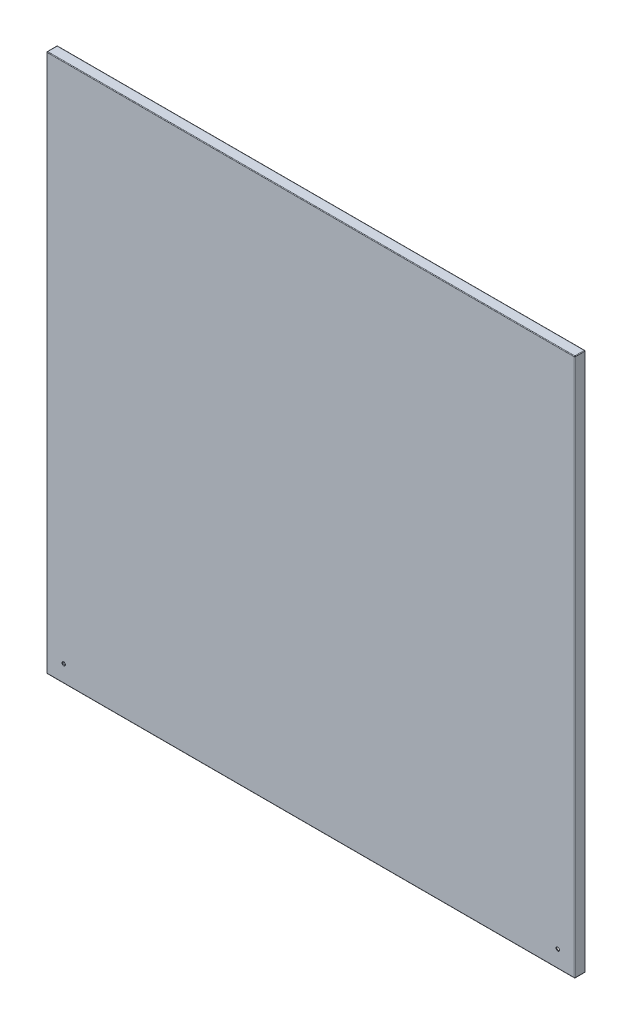
ISO-10303-21;
HEADER;
FILE_DESCRIPTION(('STEP AP214'),'2;1');
FILE_NAME('part.step','',(''),(''),'','','');
FILE_SCHEMA(('AUTOMOTIVE_DESIGN { 1 0 10303 214 1 1 1 1 }'));
ENDSEC;
DATA;
#1=APPLICATION_CONTEXT('core data for automotive mechanical design processes');
#2=APPLICATION_PROTOCOL_DEFINITION('international standard','automotive_design',2000,#1);
#3=PRODUCT_CONTEXT('',#1,'mechanical');
#4=PRODUCT('Part','Part','',(#3));
#5=PRODUCT_RELATED_PRODUCT_CATEGORY('part','',(#4));
#6=PRODUCT_DEFINITION_FORMATION('','',#4);
#7=PRODUCT_DEFINITION_CONTEXT('part definition',#1,'design');
#8=PRODUCT_DEFINITION('design','',#6,#7);
#9=PRODUCT_DEFINITION_SHAPE('','',#8);
#10=(LENGTH_UNIT() NAMED_UNIT(*) SI_UNIT(.MILLI.,.METRE.));
#11=(NAMED_UNIT(*) PLANE_ANGLE_UNIT() SI_UNIT($,.RADIAN.));
#12=(NAMED_UNIT(*) SI_UNIT($,.STERADIAN.) SOLID_ANGLE_UNIT());
#13=UNCERTAINTY_MEASURE_WITH_UNIT(LENGTH_MEASURE(1.E-05),#10,'distance_accuracy_value','');
#14=(GEOMETRIC_REPRESENTATION_CONTEXT(3) GLOBAL_UNCERTAINTY_ASSIGNED_CONTEXT((#13)) GLOBAL_UNIT_ASSIGNED_CONTEXT((#10,
#11,#12)) REPRESENTATION_CONTEXT('',''));
#15=CARTESIAN_POINT('',(0.,0.,0.));
#16=DIRECTION('',(0.,0.,1.));
#17=DIRECTION('',(1.,0.,0.));
#18=AXIS2_PLACEMENT_3D('',#15,#16,#17);
#19=CARTESIAN_POINT('',(-450.,-459.,1.5));
#20=DIRECTION('',(1.,0.,0.));
#21=DIRECTION('',(0.,0.,-1.));
#22=AXIS2_PLACEMENT_3D('',#19,#20,#21);
#23=PLANE('',#22);
#24=DIRECTION('',(0.,-1.,0.));
#25=VECTOR('',#24,1.);
#26=CARTESIAN_POINT('',(-450.,459.,0.5));
#27=LINE('',#26,#25);
#28=CARTESIAN_POINT('',(-450.,-458.,0.5));
#29=VERTEX_POINT('',#28);
#30=CARTESIAN_POINT('',(-450.,458.,0.5));
#31=VERTEX_POINT('',#30);
#32=EDGE_CURVE('E295',#29,#31,#27,.F.);
#33=ORIENTED_EDGE('',*,*,#32,.T.);
#34=DIRECTION('',(0.,0.,-1.));
#35=VECTOR('',#34,1.);
#36=CARTESIAN_POINT('',(-450.,458.,1.5));
#37=LINE('',#36,#35);
#38=CARTESIAN_POINT('',(-450.,458.,-15.5));
#39=VERTEX_POINT('',#38);
#40=EDGE_CURVE('E301',#31,#39,#37,.T.);
#41=ORIENTED_EDGE('',*,*,#40,.T.);
#42=DIRECTION('',(0.,1.,0.));
#43=VECTOR('',#42,1.);
#44=CARTESIAN_POINT('',(-450.,-459.,-15.5));
#45=LINE('',#44,#43);
#46=CARTESIAN_POINT('',(-450.,-458.,-15.5));
#47=VERTEX_POINT('',#46);
#48=EDGE_CURVE('E299',#39,#47,#45,.F.);
#49=ORIENTED_EDGE('',*,*,#48,.T.);
#50=DIRECTION('',(0.,0.,-1.));
#51=VECTOR('',#50,1.);
#52=CARTESIAN_POINT('',(-450.,-458.,1.5));
#53=LINE('',#52,#51);
#54=EDGE_CURVE('E297',#47,#29,#53,.F.);
#55=ORIENTED_EDGE('',*,*,#54,.T.);
#56=EDGE_LOOP('',(#33,#41,#49,#55));
#57=FACE_BOUND('',#56,.T.);
#58=ADVANCED_FACE('F34',(#57),#23,.F.);
#59=CARTESIAN_POINT('',(450.,-459.,1.5));
#60=DIRECTION('',(0.,1.,0.));
#61=DIRECTION('',(-1.,0.,0.));
#62=AXIS2_PLACEMENT_3D('',#59,#60,#61);
#63=PLANE('',#62);
#64=DIRECTION('',(0.,0.,-1.));
#65=VECTOR('',#64,1.);
#66=CARTESIAN_POINT('',(-449.,-459.,1.5));
#67=LINE('',#66,#65);
#68=CARTESIAN_POINT('',(-449.,-459.,0.5));
#69=VERTEX_POINT('',#68);
#70=CARTESIAN_POINT('',(-449.,-459.,-15.5));
#71=VERTEX_POINT('',#70);
#72=EDGE_CURVE('E270',#69,#71,#67,.T.);
#73=ORIENTED_EDGE('',*,*,#72,.T.);
#74=DIRECTION('',(-1.,0.,0.));
#75=VECTOR('',#74,1.);
#76=CARTESIAN_POINT('',(450.,-459.,-15.5));
#77=LINE('',#76,#75);
#78=CARTESIAN_POINT('',(449.,-459.,-15.5));
#79=VERTEX_POINT('',#78);
#80=EDGE_CURVE('E274',#71,#79,#77,.F.);
#81=ORIENTED_EDGE('',*,*,#80,.T.);
#82=DIRECTION('',(0.,0.,-1.));
#83=VECTOR('',#82,1.);
#84=CARTESIAN_POINT('',(449.,-459.,1.5));
#85=LINE('',#84,#83);
#86=CARTESIAN_POINT('',(449.,-459.,0.5));
#87=VERTEX_POINT('',#86);
#88=EDGE_CURVE('E272',#79,#87,#85,.F.);
#89=ORIENTED_EDGE('',*,*,#88,.T.);
#90=DIRECTION('',(1.,0.,0.));
#91=VECTOR('',#90,1.);
#92=CARTESIAN_POINT('',(-450.,-459.,0.5));
#93=LINE('',#92,#91);
#94=EDGE_CURVE('E268',#87,#69,#93,.F.);
#95=ORIENTED_EDGE('',*,*,#94,.T.);
#96=EDGE_LOOP('',(#73,#81,#89,#95));
#97=FACE_BOUND('',#96,.T.);
#98=ADVANCED_FACE('F404',(#97),#63,.F.);
#99=CARTESIAN_POINT('',(450.,-459.,1.5));
#100=DIRECTION('',(-1.,0.,0.));
#101=DIRECTION('',(0.,0.,1.));
#102=AXIS2_PLACEMENT_3D('',#99,#100,#101);
#103=PLANE('',#102);
#104=DIRECTION('',(0.,0.,-1.));
#105=VECTOR('',#104,1.);
#106=CARTESIAN_POINT('',(450.,-458.,1.5));
#107=LINE('',#106,#105);
#108=CARTESIAN_POINT('',(450.,-458.,0.5));
#109=VERTEX_POINT('',#108);
#110=CARTESIAN_POINT('',(450.,-458.,-15.5));
#111=VERTEX_POINT('',#110);
#112=EDGE_CURVE('E281',#109,#111,#107,.T.);
#113=ORIENTED_EDGE('',*,*,#112,.T.);
#114=DIRECTION('',(0.,-1.,0.));
#115=VECTOR('',#114,1.);
#116=CARTESIAN_POINT('',(450.,-459.,-15.5));
#117=LINE('',#116,#115);
#118=CARTESIAN_POINT('',(450.,458.,-15.5));
#119=VERTEX_POINT('',#118);
#120=EDGE_CURVE('E283',#111,#119,#117,.F.);
#121=ORIENTED_EDGE('',*,*,#120,.T.);
#122=DIRECTION('',(0.,0.,-1.));
#123=VECTOR('',#122,1.);
#124=CARTESIAN_POINT('',(450.,458.,1.5));
#125=LINE('',#124,#123);
#126=CARTESIAN_POINT('',(450.,458.,0.5));
#127=VERTEX_POINT('',#126);
#128=EDGE_CURVE('E277',#119,#127,#125,.F.);
#129=ORIENTED_EDGE('',*,*,#128,.T.);
#130=DIRECTION('',(0.,1.,0.));
#131=VECTOR('',#130,1.);
#132=CARTESIAN_POINT('',(450.,-459.,0.5));
#133=LINE('',#132,#131);
#134=EDGE_CURVE('E279',#127,#109,#133,.F.);
#135=ORIENTED_EDGE('',*,*,#134,.T.);
#136=EDGE_LOOP('',(#113,#121,#129,#135));
#137=FACE_BOUND('',#136,.T.);
#138=ADVANCED_FACE('F397',(#137),#103,.F.);
#139=CARTESIAN_POINT('',(450.,459.,1.5));
#140=DIRECTION('',(0.,-1.,0.));
#141=DIRECTION('',(1.,0.,0.));
#142=AXIS2_PLACEMENT_3D('',#139,#140,#141);
#143=PLANE('',#142);
#144=DIRECTION('',(0.,0.,-1.));
#145=VECTOR('',#144,1.);
#146=CARTESIAN_POINT('',(449.,459.,1.5));
#147=LINE('',#146,#145);
#148=CARTESIAN_POINT('',(449.,459.,0.5));
#149=VERTEX_POINT('',#148);
#150=CARTESIAN_POINT('',(449.,459.,-15.5));
#151=VERTEX_POINT('',#150);
#152=EDGE_CURVE('E286',#149,#151,#147,.T.);
#153=ORIENTED_EDGE('',*,*,#152,.T.);
#154=DIRECTION('',(1.,0.,0.));
#155=VECTOR('',#154,1.);
#156=CARTESIAN_POINT('',(450.,459.,-15.5));
#157=LINE('',#156,#155);
#158=CARTESIAN_POINT('',(-449.,459.,-15.5));
#159=VERTEX_POINT('',#158);
#160=EDGE_CURVE('E292',#151,#159,#157,.F.);
#161=ORIENTED_EDGE('',*,*,#160,.T.);
#162=DIRECTION('',(0.,0.,-1.));
#163=VECTOR('',#162,1.);
#164=CARTESIAN_POINT('',(-449.,459.,1.5));
#165=LINE('',#164,#163);
#166=CARTESIAN_POINT('',(-449.,459.,0.5));
#167=VERTEX_POINT('',#166);
#168=EDGE_CURVE('E290',#159,#167,#165,.F.);
#169=ORIENTED_EDGE('',*,*,#168,.T.);
#170=DIRECTION('',(-1.,0.,0.));
#171=VECTOR('',#170,1.);
#172=CARTESIAN_POINT('',(450.,459.,0.5));
#173=LINE('',#172,#171);
#174=EDGE_CURVE('E288',#167,#149,#173,.F.);
#175=ORIENTED_EDGE('',*,*,#174,.T.);
#176=EDGE_LOOP('',(#153,#161,#169,#175));
#177=FACE_BOUND('',#176,.T.);
#178=ADVANCED_FACE('F388',(#177),#143,.F.);
#179=CARTESIAN_POINT('',(0.,0.,1.5));
#180=DIRECTION('',(0.,0.,1.));
#181=DIRECTION('',(1.,0.,0.));
#182=AXIS2_PLACEMENT_3D('',#179,#180,#181);
#183=PLANE('',#182);
#184=DIRECTION('',(-1.,0.,0.));
#185=VECTOR('',#184,1.);
#186=CARTESIAN_POINT('',(-450.,458.,1.5));
#187=LINE('',#186,#185);
#188=CARTESIAN_POINT('',(449.,458.,1.5));
#189=VERTEX_POINT('',#188);
#190=CARTESIAN_POINT('',(-449.,458.,1.5));
#191=VERTEX_POINT('',#190);
#192=EDGE_CURVE('E58',#189,#191,#187,.T.);
#193=ORIENTED_EDGE('',*,*,#192,.T.);
#194=DIRECTION('',(0.,-1.,0.));
#195=VECTOR('',#194,1.);
#196=CARTESIAN_POINT('',(-449.,-459.,1.5));
#197=LINE('',#196,#195);
#198=CARTESIAN_POINT('',(-449.,-458.,1.5));
#199=VERTEX_POINT('',#198);
#200=EDGE_CURVE('E11',#191,#199,#197,.T.);
#201=ORIENTED_EDGE('',*,*,#200,.T.);
#202=DIRECTION('',(1.,0.,0.));
#203=VECTOR('',#202,1.);
#204=CARTESIAN_POINT('',(450.,-458.,1.5));
#205=LINE('',#204,#203);
#206=CARTESIAN_POINT('',(449.,-458.,1.5));
#207=VERTEX_POINT('',#206);
#208=EDGE_CURVE('E43',#199,#207,#205,.T.);
#209=ORIENTED_EDGE('',*,*,#208,.T.);
#210=DIRECTION('',(0.,1.,0.));
#211=VECTOR('',#210,1.);
#212=CARTESIAN_POINT('',(449.,459.,1.5));
#213=LINE('',#212,#211);
#214=EDGE_CURVE('E304',#207,#189,#213,.T.);
#215=ORIENTED_EDGE('',*,*,#214,.T.);
#216=EDGE_LOOP('',(#193,#201,#209,#215));
#217=FACE_BOUND('',#216,.T.);
#218=CARTESIAN_POINT('',(421.,-430.,1.5));
#219=DIRECTION('',(0.,0.,1.));
#220=DIRECTION('',(1.,0.,0.));
#221=AXIS2_PLACEMENT_3D('',#218,#219,#220);
#222=CIRCLE('',#221,3.00000000000005);
#223=CARTESIAN_POINT('',(424.,-430.,1.5));
#224=VERTEX_POINT('',#223);
#225=EDGE_CURVE('E259',#224,#224,#222,.T.);
#226=ORIENTED_EDGE('',*,*,#225,.F.);
#227=EDGE_LOOP('',(#226));
#228=FACE_BOUND('',#227,.T.);
#229=CARTESIAN_POINT('',(-421.,-430.,1.5));
#230=DIRECTION('',(0.,0.,1.));
#231=DIRECTION('',(1.,0.,0.));
#232=AXIS2_PLACEMENT_3D('',#229,#230,#231);
#233=CIRCLE('',#232,3.00000000000005);
#234=CARTESIAN_POINT('',(-418.,-430.,1.5));
#235=VERTEX_POINT('',#234);
#236=EDGE_CURVE('E255',#235,#235,#233,.T.);
#237=ORIENTED_EDGE('',*,*,#236,.F.);
#238=EDGE_LOOP('',(#237));
#239=FACE_BOUND('',#238,.T.);
#240=ADVANCED_FACE('F386',(#217,#228,#239),#183,.T.);
#241=CARTESIAN_POINT('',(0.,0.,-16.5));
#242=DIRECTION('',(0.,0.,1.));
#243=DIRECTION('',(1.,0.,0.));
#244=AXIS2_PLACEMENT_3D('',#241,#242,#243);
#245=PLANE('',#244);
#246=DIRECTION('',(0.,-1.,0.));
#247=VECTOR('',#246,1.);
#248=CARTESIAN_POINT('',(449.,0.,-16.5));
#249=LINE('',#248,#247);
#250=CARTESIAN_POINT('',(449.,458.,-16.5));
#251=VERTEX_POINT('',#250);
#252=CARTESIAN_POINT('',(449.,-458.,-16.5));
#253=VERTEX_POINT('',#252);
#254=EDGE_CURVE('E263',#251,#253,#249,.T.);
#255=ORIENTED_EDGE('',*,*,#254,.T.);
#256=DIRECTION('',(-1.,0.,0.));
#257=VECTOR('',#256,1.);
#258=CARTESIAN_POINT('',(0.,-458.,-16.5));
#259=LINE('',#258,#257);
#260=CARTESIAN_POINT('',(-449.,-458.,-16.5));
#261=VERTEX_POINT('',#260);
#262=EDGE_CURVE('E265',#253,#261,#259,.T.);
#263=ORIENTED_EDGE('',*,*,#262,.T.);
#264=DIRECTION('',(0.,1.,0.));
#265=VECTOR('',#264,1.);
#266=CARTESIAN_POINT('',(-449.,0.,-16.5));
#267=LINE('',#266,#265);
#268=CARTESIAN_POINT('',(-449.,458.,-16.5));
#269=VERTEX_POINT('',#268);
#270=EDGE_CURVE('E252',#261,#269,#267,.T.);
#271=ORIENTED_EDGE('',*,*,#270,.T.);
#272=DIRECTION('',(1.,0.,0.));
#273=VECTOR('',#272,1.);
#274=CARTESIAN_POINT('',(0.,458.,-16.5));
#275=LINE('',#274,#273);
#276=EDGE_CURVE('E261',#269,#251,#275,.T.);
#277=ORIENTED_EDGE('',*,*,#276,.T.);
#278=EDGE_LOOP('',(#255,#263,#271,#277));
#279=FACE_BOUND('',#278,.T.);
#280=DIRECTION('',(0.,1.,0.));
#281=VECTOR('',#280,1.);
#282=CARTESIAN_POINT('',(-435.,-449.,-16.5));
#283=LINE('',#282,#281);
#284=CARTESIAN_POINT('',(-435.,-449.,-16.5));
#285=VERTEX_POINT('',#284);
#286=CARTESIAN_POINT('',(-435.,449.,-16.5));
#287=VERTEX_POINT('',#286);
#288=EDGE_CURVE('E176',#285,#287,#283,.T.);
#289=ORIENTED_EDGE('',*,*,#288,.F.);
#290=DIRECTION('',(-1.,0.,0.));
#291=VECTOR('',#290,1.);
#292=CARTESIAN_POINT('',(435.,-449.,-16.5));
#293=LINE('',#292,#291);
#294=CARTESIAN_POINT('',(435.,-449.,-16.5));
#295=VERTEX_POINT('',#294);
#296=EDGE_CURVE('E202',#295,#285,#293,.T.);
#297=ORIENTED_EDGE('',*,*,#296,.F.);
#298=DIRECTION('',(0.,-1.,0.));
#299=VECTOR('',#298,1.);
#300=CARTESIAN_POINT('',(435.,-449.,-16.5));
#301=LINE('',#300,#299);
#302=CARTESIAN_POINT('',(435.,449.,-16.5));
#303=VERTEX_POINT('',#302);
#304=EDGE_CURVE('E200',#303,#295,#301,.T.);
#305=ORIENTED_EDGE('',*,*,#304,.F.);
#306=DIRECTION('',(1.,0.,0.));
#307=VECTOR('',#306,1.);
#308=CARTESIAN_POINT('',(435.,449.,-16.5));
#309=LINE('',#308,#307);
#310=EDGE_CURVE('E186',#287,#303,#309,.T.);
#311=ORIENTED_EDGE('',*,*,#310,.F.);
#312=EDGE_LOOP('',(#289,#297,#305,#311));
#313=FACE_BOUND('',#312,.T.);
#314=ADVANCED_FACE('F198',(#279,#313),#245,.F.);
#315=CARTESIAN_POINT('',(0.,0.,-15.));
#316=DIRECTION('',(0.,0.,1.));
#317=DIRECTION('',(1.,0.,0.));
#318=AXIS2_PLACEMENT_3D('',#315,#316,#317);
#319=PLANE('',#318);
#320=DIRECTION('',(1.,0.,0.));
#321=VECTOR('',#320,1.);
#322=CARTESIAN_POINT('',(448.5,457.5,-15.));
#323=LINE('',#322,#321);
#324=CARTESIAN_POINT('',(-448.5,457.5,-15.));
#325=VERTEX_POINT('',#324);
#326=CARTESIAN_POINT('',(448.5,457.5,-15.));
#327=VERTEX_POINT('',#326);
#328=EDGE_CURVE('E223',#325,#327,#323,.T.);
#329=ORIENTED_EDGE('',*,*,#328,.F.);
#330=DIRECTION('',(0.,1.,0.));
#331=VECTOR('',#330,1.);
#332=CARTESIAN_POINT('',(-448.5,-457.5,-15.));
#333=LINE('',#332,#331);
#334=CARTESIAN_POINT('',(-448.5,-457.5,-15.));
#335=VERTEX_POINT('',#334);
#336=EDGE_CURVE('E220',#335,#325,#333,.T.);
#337=ORIENTED_EDGE('',*,*,#336,.F.);
#338=DIRECTION('',(-1.,0.,0.));
#339=VECTOR('',#338,1.);
#340=CARTESIAN_POINT('',(448.5,-457.5,-15.));
#341=LINE('',#340,#339);
#342=CARTESIAN_POINT('',(448.5,-457.5,-15.));
#343=VERTEX_POINT('',#342);
#344=EDGE_CURVE('E230',#343,#335,#341,.T.);
#345=ORIENTED_EDGE('',*,*,#344,.F.);
#346=DIRECTION('',(0.,-1.,0.));
#347=VECTOR('',#346,1.);
#348=CARTESIAN_POINT('',(448.5,-457.5,-15.));
#349=LINE('',#348,#347);
#350=EDGE_CURVE('E227',#327,#343,#349,.T.);
#351=ORIENTED_EDGE('',*,*,#350,.F.);
#352=EDGE_LOOP('',(#329,#337,#345,#351));
#353=FACE_BOUND('',#352,.T.);
#354=DIRECTION('',(-1.,0.,0.));
#355=VECTOR('',#354,1.);
#356=CARTESIAN_POINT('',(435.,-449.,-15.));
#357=LINE('',#356,#355);
#358=CARTESIAN_POINT('',(435.,-449.,-15.));
#359=VERTEX_POINT('',#358);
#360=CARTESIAN_POINT('',(-435.,-449.,-15.));
#361=VERTEX_POINT('',#360);
#362=EDGE_CURVE('E187',#359,#361,#357,.T.);
#363=ORIENTED_EDGE('',*,*,#362,.T.);
#364=DIRECTION('',(0.,1.,0.));
#365=VECTOR('',#364,1.);
#366=CARTESIAN_POINT('',(-435.,-449.,-15.));
#367=LINE('',#366,#365);
#368=CARTESIAN_POINT('',(-435.,449.,-15.));
#369=VERTEX_POINT('',#368);
#370=EDGE_CURVE('E207',#361,#369,#367,.T.);
#371=ORIENTED_EDGE('',*,*,#370,.T.);
#372=DIRECTION('',(1.,0.,0.));
#373=VECTOR('',#372,1.);
#374=CARTESIAN_POINT('',(435.,449.,-15.));
#375=LINE('',#374,#373);
#376=CARTESIAN_POINT('',(435.,449.,-15.));
#377=VERTEX_POINT('',#376);
#378=EDGE_CURVE('E193',#369,#377,#375,.T.);
#379=ORIENTED_EDGE('',*,*,#378,.T.);
#380=DIRECTION('',(0.,-1.,0.));
#381=VECTOR('',#380,1.);
#382=CARTESIAN_POINT('',(435.,-449.,-15.));
#383=LINE('',#382,#381);
#384=EDGE_CURVE('E211',#377,#359,#383,.T.);
#385=ORIENTED_EDGE('',*,*,#384,.T.);
#386=EDGE_LOOP('',(#363,#371,#379,#385));
#387=FACE_BOUND('',#386,.T.);
#388=ADVANCED_FACE('F394',(#353,#387),#319,.T.);
#389=CARTESIAN_POINT('',(-435.,-449.,-16.5));
#390=DIRECTION('',(1.,0.,0.));
#391=DIRECTION('',(0.,0.,-1.));
#392=AXIS2_PLACEMENT_3D('',#389,#390,#391);
#393=PLANE('',#392);
#394=ORIENTED_EDGE('',*,*,#370,.F.);
#395=DIRECTION('',(0.,0.,1.));
#396=VECTOR('',#395,1.);
#397=CARTESIAN_POINT('',(-435.,-449.,-16.5));
#398=LINE('',#397,#396);
#399=EDGE_CURVE('E182',#285,#361,#398,.T.);
#400=ORIENTED_EDGE('',*,*,#399,.F.);
#401=ORIENTED_EDGE('',*,*,#288,.T.);
#402=DIRECTION('',(0.,0.,1.));
#403=VECTOR('',#402,1.);
#404=CARTESIAN_POINT('',(-435.,449.,-16.5));
#405=LINE('',#404,#403);
#406=EDGE_CURVE('E179',#287,#369,#405,.T.);
#407=ORIENTED_EDGE('',*,*,#406,.T.);
#408=EDGE_LOOP('',(#394,#400,#401,#407));
#409=FACE_BOUND('',#408,.T.);
#410=ADVANCED_FACE('F178',(#409),#393,.T.);
#411=CARTESIAN_POINT('',(435.,449.,-16.5));
#412=DIRECTION('',(0.,-1.,0.));
#413=DIRECTION('',(0.,0.,-1.));
#414=AXIS2_PLACEMENT_3D('',#411,#412,#413);
#415=PLANE('',#414);
#416=ORIENTED_EDGE('',*,*,#378,.F.);
#417=ORIENTED_EDGE('',*,*,#406,.F.);
#418=ORIENTED_EDGE('',*,*,#310,.T.);
#419=DIRECTION('',(0.,0.,1.));
#420=VECTOR('',#419,1.);
#421=CARTESIAN_POINT('',(435.,449.,-16.5));
#422=LINE('',#421,#420);
#423=EDGE_CURVE('E195',#303,#377,#422,.T.);
#424=ORIENTED_EDGE('',*,*,#423,.T.);
#425=EDGE_LOOP('',(#416,#417,#418,#424));
#426=FACE_BOUND('',#425,.T.);
#427=ADVANCED_FACE('F190',(#426),#415,.T.);
#428=CARTESIAN_POINT('',(435.,-449.,-16.5));
#429=DIRECTION('',(-1.,0.,0.));
#430=DIRECTION('',(0.,0.,1.));
#431=AXIS2_PLACEMENT_3D('',#428,#429,#430);
#432=PLANE('',#431);
#433=ORIENTED_EDGE('',*,*,#384,.F.);
#434=ORIENTED_EDGE('',*,*,#423,.F.);
#435=ORIENTED_EDGE('',*,*,#304,.T.);
#436=DIRECTION('',(0.,0.,1.));
#437=VECTOR('',#436,1.);
#438=CARTESIAN_POINT('',(435.,-449.,-16.5));
#439=LINE('',#438,#437);
#440=EDGE_CURVE('E217',#295,#359,#439,.T.);
#441=ORIENTED_EDGE('',*,*,#440,.T.);
#442=EDGE_LOOP('',(#433,#434,#435,#441));
#443=FACE_BOUND('',#442,.T.);
#444=ADVANCED_FACE('F543',(#443),#432,.T.);
#445=CARTESIAN_POINT('',(435.,-449.,-16.5));
#446=DIRECTION('',(0.,1.,0.));
#447=DIRECTION('',(0.,0.,1.));
#448=AXIS2_PLACEMENT_3D('',#445,#446,#447);
#449=PLANE('',#448);
#450=ORIENTED_EDGE('',*,*,#362,.F.);
#451=ORIENTED_EDGE('',*,*,#440,.F.);
#452=ORIENTED_EDGE('',*,*,#296,.T.);
#453=ORIENTED_EDGE('',*,*,#399,.T.);
#454=EDGE_LOOP('',(#450,#451,#452,#453));
#455=FACE_BOUND('',#454,.T.);
#456=ADVANCED_FACE('F534',(#455),#449,.T.);
#457=CARTESIAN_POINT('',(0.,0.,0.));
#458=DIRECTION('',(0.,0.,1.));
#459=DIRECTION('',(1.,0.,0.));
#460=AXIS2_PLACEMENT_3D('',#457,#458,#459);
#461=PLANE('',#460);
#462=CARTESIAN_POINT('',(421.,-430.,0.));
#463=DIRECTION('',(0.,0.,1.));
#464=DIRECTION('',(1.,0.,0.));
#465=AXIS2_PLACEMENT_3D('',#462,#463,#464);
#466=CIRCLE('',#465,3.00000000000005);
#467=CARTESIAN_POINT('',(424.,-430.,0.));
#468=VERTEX_POINT('',#467);
#469=EDGE_CURVE('E256',#468,#468,#466,.T.);
#470=ORIENTED_EDGE('',*,*,#469,.T.);
#471=EDGE_LOOP('',(#470));
#472=FACE_BOUND('',#471,.T.);
#473=CARTESIAN_POINT('',(-421.,-430.,0.));
#474=DIRECTION('',(0.,0.,1.));
#475=DIRECTION('',(1.,0.,0.));
#476=AXIS2_PLACEMENT_3D('',#473,#474,#475);
#477=CIRCLE('',#476,3.00000000000005);
#478=CARTESIAN_POINT('',(-418.,-430.,0.));
#479=VERTEX_POINT('',#478);
#480=EDGE_CURVE('E209',#479,#479,#477,.T.);
#481=ORIENTED_EDGE('',*,*,#480,.T.);
#482=EDGE_LOOP('',(#481));
#483=FACE_BOUND('',#482,.T.);
#484=DIRECTION('',(-1.,0.,0.));
#485=VECTOR('',#484,1.);
#486=CARTESIAN_POINT('',(448.5,-457.5,0.));
#487=LINE('',#486,#485);
#488=CARTESIAN_POINT('',(448.5,-457.5,0.));
#489=VERTEX_POINT('',#488);
#490=CARTESIAN_POINT('',(-448.5,-457.5,0.));
#491=VERTEX_POINT('',#490);
#492=EDGE_CURVE('E224',#489,#491,#487,.T.);
#493=ORIENTED_EDGE('',*,*,#492,.T.);
#494=DIRECTION('',(0.,1.,0.));
#495=VECTOR('',#494,1.);
#496=CARTESIAN_POINT('',(-448.5,-457.5,0.));
#497=LINE('',#496,#495);
#498=CARTESIAN_POINT('',(-448.5,457.5,0.));
#499=VERTEX_POINT('',#498);
#500=EDGE_CURVE('E194',#491,#499,#497,.T.);
#501=ORIENTED_EDGE('',*,*,#500,.T.);
#502=DIRECTION('',(1.,0.,0.));
#503=VECTOR('',#502,1.);
#504=CARTESIAN_POINT('',(448.5,457.5,0.));
#505=LINE('',#504,#503);
#506=CARTESIAN_POINT('',(448.5,457.5,0.));
#507=VERTEX_POINT('',#506);
#508=EDGE_CURVE('E236',#499,#507,#505,.T.);
#509=ORIENTED_EDGE('',*,*,#508,.T.);
#510=DIRECTION('',(0.,-1.,0.));
#511=VECTOR('',#510,1.);
#512=CARTESIAN_POINT('',(448.5,-457.5,0.));
#513=LINE('',#512,#511);
#514=EDGE_CURVE('E239',#507,#489,#513,.T.);
#515=ORIENTED_EDGE('',*,*,#514,.T.);
#516=EDGE_LOOP('',(#493,#501,#509,#515));
#517=FACE_BOUND('',#516,.T.);
#518=ADVANCED_FACE('F531',(#472,#483,#517),#461,.F.);
#519=CARTESIAN_POINT('',(448.5,-457.5,-15.));
#520=DIRECTION('',(0.,1.,0.));
#521=DIRECTION('',(0.,0.,1.));
#522=AXIS2_PLACEMENT_3D('',#519,#520,#521);
#523=PLANE('',#522);
#524=ORIENTED_EDGE('',*,*,#492,.F.);
#525=DIRECTION('',(0.,0.,1.));
#526=VECTOR('',#525,1.);
#527=CARTESIAN_POINT('',(448.5,-457.5,-15.));
#528=LINE('',#527,#526);
#529=EDGE_CURVE('E245',#343,#489,#528,.T.);
#530=ORIENTED_EDGE('',*,*,#529,.F.);
#531=ORIENTED_EDGE('',*,*,#344,.T.);
#532=DIRECTION('',(0.,0.,1.));
#533=VECTOR('',#532,1.);
#534=CARTESIAN_POINT('',(-448.5,-457.5,-15.));
#535=LINE('',#534,#533);
#536=EDGE_CURVE('E233',#335,#491,#535,.T.);
#537=ORIENTED_EDGE('',*,*,#536,.T.);
#538=EDGE_LOOP('',(#524,#530,#531,#537));
#539=FACE_BOUND('',#538,.T.);
#540=ADVANCED_FACE('F533',(#539),#523,.T.);
#541=CARTESIAN_POINT('',(448.5,-457.5,-15.));
#542=DIRECTION('',(-1.,0.,0.));
#543=DIRECTION('',(0.,0.,1.));
#544=AXIS2_PLACEMENT_3D('',#541,#542,#543);
#545=PLANE('',#544);
#546=ORIENTED_EDGE('',*,*,#514,.F.);
#547=DIRECTION('',(0.,0.,1.));
#548=VECTOR('',#547,1.);
#549=CARTESIAN_POINT('',(448.5,457.5,-15.));
#550=LINE('',#549,#548);
#551=EDGE_CURVE('E247',#327,#507,#550,.T.);
#552=ORIENTED_EDGE('',*,*,#551,.F.);
#553=ORIENTED_EDGE('',*,*,#350,.T.);
#554=ORIENTED_EDGE('',*,*,#529,.T.);
#555=EDGE_LOOP('',(#546,#552,#553,#554));
#556=FACE_BOUND('',#555,.T.);
#557=ADVANCED_FACE('F540',(#556),#545,.T.);
#558=CARTESIAN_POINT('',(448.5,457.5,-15.));
#559=DIRECTION('',(0.,-1.,0.));
#560=DIRECTION('',(0.,0.,-1.));
#561=AXIS2_PLACEMENT_3D('',#558,#559,#560);
#562=PLANE('',#561);
#563=ORIENTED_EDGE('',*,*,#508,.F.);
#564=DIRECTION('',(0.,0.,1.));
#565=VECTOR('',#564,1.);
#566=CARTESIAN_POINT('',(-448.5,457.5,-15.));
#567=LINE('',#566,#565);
#568=EDGE_CURVE('E249',#325,#499,#567,.T.);
#569=ORIENTED_EDGE('',*,*,#568,.F.);
#570=ORIENTED_EDGE('',*,*,#328,.T.);
#571=ORIENTED_EDGE('',*,*,#551,.T.);
#572=EDGE_LOOP('',(#563,#569,#570,#571));
#573=FACE_BOUND('',#572,.T.);
#574=ADVANCED_FACE('F559',(#573),#562,.T.);
#575=CARTESIAN_POINT('',(-448.5,-457.5,-15.));
#576=DIRECTION('',(1.,0.,0.));
#577=DIRECTION('',(0.,0.,-1.));
#578=AXIS2_PLACEMENT_3D('',#575,#576,#577);
#579=PLANE('',#578);
#580=ORIENTED_EDGE('',*,*,#500,.F.);
#581=ORIENTED_EDGE('',*,*,#536,.F.);
#582=ORIENTED_EDGE('',*,*,#336,.T.);
#583=ORIENTED_EDGE('',*,*,#568,.T.);
#584=EDGE_LOOP('',(#580,#581,#582,#583));
#585=FACE_BOUND('',#584,.T.);
#586=ADVANCED_FACE('F556',(#585),#579,.T.);
#587=CARTESIAN_POINT('',(-421.,-430.,-16.5));
#588=DIRECTION('',(0.,0.,1.));
#589=DIRECTION('',(1.,0.,0.));
#590=AXIS2_PLACEMENT_3D('',#587,#588,#589);
#591=CYLINDRICAL_SURFACE('',#590,3.00000000000005);
#592=ORIENTED_EDGE('',*,*,#236,.T.);
#593=EDGE_LOOP('',(#592));
#594=FACE_BOUND('',#593,.T.);
#595=ORIENTED_EDGE('',*,*,#480,.F.);
#596=EDGE_LOOP('',(#595));
#597=FACE_BOUND('',#596,.T.);
#598=ADVANCED_FACE('F383',(#594,#597),#591,.F.);
#599=CARTESIAN_POINT('',(421.,-430.,-16.5));
#600=DIRECTION('',(0.,0.,1.));
#601=DIRECTION('',(1.,0.,0.));
#602=AXIS2_PLACEMENT_3D('',#599,#600,#601);
#603=CYLINDRICAL_SURFACE('',#602,3.00000000000005);
#604=ORIENTED_EDGE('',*,*,#225,.T.);
#605=EDGE_LOOP('',(#604));
#606=FACE_BOUND('',#605,.T.);
#607=ORIENTED_EDGE('',*,*,#469,.F.);
#608=EDGE_LOOP('',(#607));
#609=FACE_BOUND('',#608,.T.);
#610=ADVANCED_FACE('F488',(#606,#609),#603,.F.);
#611=CARTESIAN_POINT('',(0.,458.,0.5));
#612=DIRECTION('',(1.,0.,0.));
#613=DIRECTION('',(0.,1.,0.));
#614=AXIS2_PLACEMENT_3D('',#611,#612,#613);
#615=CYLINDRICAL_SURFACE('',#614,1.);
#616=CARTESIAN_POINT('',(449.,458.,0.5));
#617=DIRECTION('',(1.,0.,0.));
#618=DIRECTION('',(0.,0.,-1.));
#619=AXIS2_PLACEMENT_3D('',#616,#617,#618);
#620=CIRCLE('',#619,1.);
#621=EDGE_CURVE('E38',#149,#189,#620,.T.);
#622=ORIENTED_EDGE('',*,*,#621,.F.);
#623=ORIENTED_EDGE('',*,*,#174,.F.);
#624=CARTESIAN_POINT('',(-449.,458.,0.5));
#625=DIRECTION('',(-1.,0.,0.));
#626=DIRECTION('',(0.,0.,1.));
#627=AXIS2_PLACEMENT_3D('',#624,#625,#626);
#628=CIRCLE('',#627,1.);
#629=EDGE_CURVE('E366',#191,#167,#628,.T.);
#630=ORIENTED_EDGE('',*,*,#629,.F.);
#631=ORIENTED_EDGE('',*,*,#192,.F.);
#632=EDGE_LOOP('',(#622,#623,#630,#631));
#633=FACE_BOUND('',#632,.T.);
#634=ADVANCED_FACE('F36',(#633),#615,.T.);
#635=CARTESIAN_POINT('',(449.,458.,0.5));
#636=DIRECTION('',(0.,0.,1.));
#637=DIRECTION('',(1.,0.,0.));
#638=AXIS2_PLACEMENT_3D('',#635,#636,#637);
#639=SPHERICAL_SURFACE('',#638,1.);
#640=CARTESIAN_POINT('',(449.,458.,0.5));
#641=DIRECTION('',(0.,0.,1.));
#642=DIRECTION('',(1.,0.,0.));
#643=AXIS2_PLACEMENT_3D('',#640,#641,#642);
#644=CIRCLE('',#643,1.);
#645=EDGE_CURVE('E361',#149,#127,#644,.F.);
#646=ORIENTED_EDGE('',*,*,#645,.F.);
#647=ORIENTED_EDGE('',*,*,#621,.T.);
#648=CARTESIAN_POINT('',(449.,458.,0.5));
#649=DIRECTION('',(0.,1.,0.));
#650=DIRECTION('',(0.,0.,1.));
#651=AXIS2_PLACEMENT_3D('',#648,#649,#650);
#652=CIRCLE('',#651,1.);
#653=EDGE_CURVE('E364',#127,#189,#652,.F.);
#654=ORIENTED_EDGE('',*,*,#653,.F.);
#655=EDGE_LOOP('',(#646,#647,#654));
#656=FACE_BOUND('',#655,.T.);
#657=ADVANCED_FACE('F483',(#656),#639,.T.);
#658=CARTESIAN_POINT('',(-449.,458.,0.5));
#659=DIRECTION('',(0.,0.,1.));
#660=DIRECTION('',(1.,0.,0.));
#661=AXIS2_PLACEMENT_3D('',#658,#659,#660);
#662=SPHERICAL_SURFACE('',#661,1.);
#663=CARTESIAN_POINT('',(-449.,458.,0.5));
#664=DIRECTION('',(0.,1.,0.));
#665=DIRECTION('',(0.,0.,1.));
#666=AXIS2_PLACEMENT_3D('',#663,#664,#665);
#667=CIRCLE('',#666,1.);
#668=EDGE_CURVE('E355',#191,#31,#667,.F.);
#669=ORIENTED_EDGE('',*,*,#668,.F.);
#670=ORIENTED_EDGE('',*,*,#629,.T.);
#671=CARTESIAN_POINT('',(-449.,458.,0.5));
#672=DIRECTION('',(0.,0.,1.));
#673=DIRECTION('',(1.,0.,0.));
#674=AXIS2_PLACEMENT_3D('',#671,#672,#673);
#675=CIRCLE('',#674,1.);
#676=EDGE_CURVE('E358',#31,#167,#675,.F.);
#677=ORIENTED_EDGE('',*,*,#676,.F.);
#678=EDGE_LOOP('',(#669,#670,#677));
#679=FACE_BOUND('',#678,.T.);
#680=ADVANCED_FACE('F480',(#679),#662,.T.);
#681=CARTESIAN_POINT('',(449.,0.,0.5));
#682=DIRECTION('',(0.,-1.,0.));
#683=DIRECTION('',(0.,0.,-1.));
#684=AXIS2_PLACEMENT_3D('',#681,#682,#683);
#685=CYLINDRICAL_SURFACE('',#684,1.);
#686=ORIENTED_EDGE('',*,*,#653,.T.);
#687=ORIENTED_EDGE('',*,*,#214,.F.);
#688=CARTESIAN_POINT('',(449.,-458.,0.5));
#689=DIRECTION('',(0.,-1.,0.));
#690=DIRECTION('',(0.,0.,-1.));
#691=AXIS2_PLACEMENT_3D('',#688,#689,#690);
#692=CIRCLE('',#691,1.);
#693=EDGE_CURVE('E349',#109,#207,#692,.T.);
#694=ORIENTED_EDGE('',*,*,#693,.F.);
#695=ORIENTED_EDGE('',*,*,#134,.F.);
#696=EDGE_LOOP('',(#686,#687,#694,#695));
#697=FACE_BOUND('',#696,.T.);
#698=ADVANCED_FACE('F476',(#697),#685,.T.);
#699=CARTESIAN_POINT('',(449.,458.,1.5));
#700=DIRECTION('',(0.,0.,-1.));
#701=DIRECTION('',(-1.,0.,0.));
#702=AXIS2_PLACEMENT_3D('',#699,#700,#701);
#703=CYLINDRICAL_SURFACE('',#702,1.);
#704=ORIENTED_EDGE('',*,*,#645,.T.);
#705=ORIENTED_EDGE('',*,*,#128,.F.);
#706=CARTESIAN_POINT('',(449.,458.,-15.5));
#707=DIRECTION('',(0.,0.,-1.));
#708=DIRECTION('',(-1.,0.,0.));
#709=AXIS2_PLACEMENT_3D('',#706,#707,#708);
#710=CIRCLE('',#709,1.);
#711=EDGE_CURVE('E346',#151,#119,#710,.T.);
#712=ORIENTED_EDGE('',*,*,#711,.F.);
#713=ORIENTED_EDGE('',*,*,#152,.F.);
#714=EDGE_LOOP('',(#704,#705,#712,#713));
#715=FACE_BOUND('',#714,.T.);
#716=ADVANCED_FACE('F472',(#715),#703,.T.);
#717=CARTESIAN_POINT('',(0.,458.,-15.5));
#718=DIRECTION('',(1.,0.,0.));
#719=DIRECTION('',(0.,1.,0.));
#720=AXIS2_PLACEMENT_3D('',#717,#718,#719);
#721=CYLINDRICAL_SURFACE('',#720,1.);
#722=CARTESIAN_POINT('',(-449.,458.,-15.5));
#723=DIRECTION('',(-1.,0.,0.));
#724=DIRECTION('',(0.,0.,1.));
#725=AXIS2_PLACEMENT_3D('',#722,#723,#724);
#726=CIRCLE('',#725,1.);
#727=EDGE_CURVE('E340',#159,#269,#726,.T.);
#728=ORIENTED_EDGE('',*,*,#727,.F.);
#729=ORIENTED_EDGE('',*,*,#160,.F.);
#730=CARTESIAN_POINT('',(449.,458.,-15.5));
#731=DIRECTION('',(1.,0.,0.));
#732=DIRECTION('',(0.,0.,-1.));
#733=AXIS2_PLACEMENT_3D('',#730,#731,#732);
#734=CIRCLE('',#733,1.);
#735=EDGE_CURVE('E343',#251,#151,#734,.T.);
#736=ORIENTED_EDGE('',*,*,#735,.F.);
#737=ORIENTED_EDGE('',*,*,#276,.F.);
#738=EDGE_LOOP('',(#728,#729,#736,#737));
#739=FACE_BOUND('',#738,.T.);
#740=ADVANCED_FACE('F468',(#739),#721,.T.);
#741=CARTESIAN_POINT('',(-449.,458.,1.5));
#742=DIRECTION('',(0.,0.,-1.));
#743=DIRECTION('',(-1.,0.,0.));
#744=AXIS2_PLACEMENT_3D('',#741,#742,#743);
#745=CYLINDRICAL_SURFACE('',#744,1.);
#746=ORIENTED_EDGE('',*,*,#676,.T.);
#747=ORIENTED_EDGE('',*,*,#168,.F.);
#748=CARTESIAN_POINT('',(-449.,458.,-15.5));
#749=DIRECTION('',(0.,0.,-1.));
#750=DIRECTION('',(-1.,0.,0.));
#751=AXIS2_PLACEMENT_3D('',#748,#749,#750);
#752=CIRCLE('',#751,1.);
#753=EDGE_CURVE('E338',#39,#159,#752,.T.);
#754=ORIENTED_EDGE('',*,*,#753,.F.);
#755=ORIENTED_EDGE('',*,*,#40,.F.);
#756=EDGE_LOOP('',(#746,#747,#754,#755));
#757=FACE_BOUND('',#756,.T.);
#758=ADVANCED_FACE('F464',(#757),#745,.T.);
#759=CARTESIAN_POINT('',(-449.,0.,0.5));
#760=DIRECTION('',(0.,1.,0.));
#761=DIRECTION('',(0.,0.,1.));
#762=AXIS2_PLACEMENT_3D('',#759,#760,#761);
#763=CYLINDRICAL_SURFACE('',#762,1.);
#764=ORIENTED_EDGE('',*,*,#668,.T.);
#765=ORIENTED_EDGE('',*,*,#32,.F.);
#766=CARTESIAN_POINT('',(-449.,-458.,0.5));
#767=DIRECTION('',(0.,-1.,0.));
#768=DIRECTION('',(0.,0.,-1.));
#769=AXIS2_PLACEMENT_3D('',#766,#767,#768);
#770=CIRCLE('',#769,1.);
#771=EDGE_CURVE('E336',#199,#29,#770,.T.);
#772=ORIENTED_EDGE('',*,*,#771,.F.);
#773=ORIENTED_EDGE('',*,*,#200,.F.);
#774=EDGE_LOOP('',(#764,#765,#772,#773));
#775=FACE_BOUND('',#774,.T.);
#776=ADVANCED_FACE('F460',(#775),#763,.T.);
#777=CARTESIAN_POINT('',(0.,-458.,0.5));
#778=DIRECTION('',(-1.,0.,0.));
#779=DIRECTION('',(0.,-1.,0.));
#780=AXIS2_PLACEMENT_3D('',#777,#778,#779);
#781=CYLINDRICAL_SURFACE('',#780,1.);
#782=CARTESIAN_POINT('',(449.,-458.,0.5));
#783=DIRECTION('',(1.,0.,0.));
#784=DIRECTION('',(0.,0.,-1.));
#785=AXIS2_PLACEMENT_3D('',#782,#783,#784);
#786=CIRCLE('',#785,1.);
#787=EDGE_CURVE('E352',#207,#87,#786,.T.);
#788=ORIENTED_EDGE('',*,*,#787,.F.);
#789=ORIENTED_EDGE('',*,*,#208,.F.);
#790=CARTESIAN_POINT('',(-449.,-458.,0.5));
#791=DIRECTION('',(-1.,0.,0.));
#792=DIRECTION('',(0.,0.,1.));
#793=AXIS2_PLACEMENT_3D('',#790,#791,#792);
#794=CIRCLE('',#793,1.);
#795=EDGE_CURVE('E51',#69,#199,#794,.T.);
#796=ORIENTED_EDGE('',*,*,#795,.F.);
#797=ORIENTED_EDGE('',*,*,#94,.F.);
#798=EDGE_LOOP('',(#788,#789,#796,#797));
#799=FACE_BOUND('',#798,.T.);
#800=ADVANCED_FACE('F456',(#799),#781,.T.);
#801=CARTESIAN_POINT('',(449.,-458.,0.5));
#802=DIRECTION('',(0.,0.,1.));
#803=DIRECTION('',(1.,0.,0.));
#804=AXIS2_PLACEMENT_3D('',#801,#802,#803);
#805=SPHERICAL_SURFACE('',#804,1.);
#806=ORIENTED_EDGE('',*,*,#693,.T.);
#807=ORIENTED_EDGE('',*,*,#787,.T.);
#808=CARTESIAN_POINT('',(449.,-458.,0.5));
#809=DIRECTION('',(0.,0.,1.));
#810=DIRECTION('',(1.,0.,0.));
#811=AXIS2_PLACEMENT_3D('',#808,#809,#810);
#812=CIRCLE('',#811,1.);
#813=EDGE_CURVE('E332',#109,#87,#812,.F.);
#814=ORIENTED_EDGE('',*,*,#813,.F.);
#815=EDGE_LOOP('',(#806,#807,#814));
#816=FACE_BOUND('',#815,.T.);
#817=ADVANCED_FACE('F452',(#816),#805,.T.);
#818=CARTESIAN_POINT('',(449.,458.,-15.5));
#819=DIRECTION('',(0.,0.,1.));
#820=DIRECTION('',(1.,0.,0.));
#821=AXIS2_PLACEMENT_3D('',#818,#819,#820);
#822=SPHERICAL_SURFACE('',#821,1.);
#823=ORIENTED_EDGE('',*,*,#735,.T.);
#824=ORIENTED_EDGE('',*,*,#711,.T.);
#825=CARTESIAN_POINT('',(449.,458.,-15.5));
#826=DIRECTION('',(0.,1.,0.));
#827=DIRECTION('',(0.,0.,1.));
#828=AXIS2_PLACEMENT_3D('',#825,#826,#827);
#829=CIRCLE('',#828,1.);
#830=EDGE_CURVE('E330',#251,#119,#829,.F.);
#831=ORIENTED_EDGE('',*,*,#830,.F.);
#832=EDGE_LOOP('',(#823,#824,#831));
#833=FACE_BOUND('',#832,.T.);
#834=ADVANCED_FACE('F448',(#833),#822,.T.);
#835=CARTESIAN_POINT('',(-449.,458.,-15.5));
#836=DIRECTION('',(0.,0.,1.));
#837=DIRECTION('',(1.,0.,0.));
#838=AXIS2_PLACEMENT_3D('',#835,#836,#837);
#839=SPHERICAL_SURFACE('',#838,1.);
#840=ORIENTED_EDGE('',*,*,#753,.T.);
#841=ORIENTED_EDGE('',*,*,#727,.T.);
#842=CARTESIAN_POINT('',(-449.,458.,-15.5));
#843=DIRECTION('',(0.,1.,0.));
#844=DIRECTION('',(-1.,0.,0.));
#845=AXIS2_PLACEMENT_3D('',#842,#843,#844);
#846=CIRCLE('',#845,1.);
#847=EDGE_CURVE('E327',#39,#269,#846,.F.);
#848=ORIENTED_EDGE('',*,*,#847,.F.);
#849=EDGE_LOOP('',(#840,#841,#848));
#850=FACE_BOUND('',#849,.T.);
#851=ADVANCED_FACE('F445',(#850),#839,.T.);
#852=CARTESIAN_POINT('',(-449.,-458.,0.5));
#853=DIRECTION('',(0.,0.,1.));
#854=DIRECTION('',(1.,0.,0.));
#855=AXIS2_PLACEMENT_3D('',#852,#853,#854);
#856=SPHERICAL_SURFACE('',#855,1.);
#857=ORIENTED_EDGE('',*,*,#795,.T.);
#858=ORIENTED_EDGE('',*,*,#771,.T.);
#859=CARTESIAN_POINT('',(-449.,-458.,0.5));
#860=DIRECTION('',(0.,0.,1.));
#861=DIRECTION('',(1.,0.,0.));
#862=AXIS2_PLACEMENT_3D('',#859,#860,#861);
#863=CIRCLE('',#862,1.);
#864=EDGE_CURVE('E324',#69,#29,#863,.F.);
#865=ORIENTED_EDGE('',*,*,#864,.F.);
#866=EDGE_LOOP('',(#857,#858,#865));
#867=FACE_BOUND('',#866,.T.);
#868=ADVANCED_FACE('F441',(#867),#856,.T.);
#869=CARTESIAN_POINT('',(449.,-458.,1.5));
#870=DIRECTION('',(0.,0.,-1.));
#871=DIRECTION('',(-1.,0.,0.));
#872=AXIS2_PLACEMENT_3D('',#869,#870,#871);
#873=CYLINDRICAL_SURFACE('',#872,1.);
#874=ORIENTED_EDGE('',*,*,#813,.T.);
#875=ORIENTED_EDGE('',*,*,#88,.F.);
#876=CARTESIAN_POINT('',(449.,-458.,-15.5));
#877=DIRECTION('',(0.,0.,-1.));
#878=DIRECTION('',(-1.,0.,0.));
#879=AXIS2_PLACEMENT_3D('',#876,#877,#878);
#880=CIRCLE('',#879,1.);
#881=EDGE_CURVE('E321',#111,#79,#880,.T.);
#882=ORIENTED_EDGE('',*,*,#881,.F.);
#883=ORIENTED_EDGE('',*,*,#112,.F.);
#884=EDGE_LOOP('',(#874,#875,#882,#883));
#885=FACE_BOUND('',#884,.T.);
#886=ADVANCED_FACE('F437',(#885),#873,.T.);
#887=CARTESIAN_POINT('',(449.,0.,-15.5));
#888=DIRECTION('',(0.,-1.,0.));
#889=DIRECTION('',(0.,0.,-1.));
#890=AXIS2_PLACEMENT_3D('',#887,#888,#889);
#891=CYLINDRICAL_SURFACE('',#890,1.);
#892=ORIENTED_EDGE('',*,*,#830,.T.);
#893=ORIENTED_EDGE('',*,*,#120,.F.);
#894=CARTESIAN_POINT('',(449.,-458.,-15.5));
#895=DIRECTION('',(0.,-1.,0.));
#896=DIRECTION('',(0.,0.,-1.));
#897=AXIS2_PLACEMENT_3D('',#894,#895,#896);
#898=CIRCLE('',#897,1.);
#899=EDGE_CURVE('E318',#253,#111,#898,.T.);
#900=ORIENTED_EDGE('',*,*,#899,.F.);
#901=ORIENTED_EDGE('',*,*,#254,.F.);
#902=EDGE_LOOP('',(#892,#893,#900,#901));
#903=FACE_BOUND('',#902,.T.);
#904=ADVANCED_FACE('F433',(#903),#891,.T.);
#905=CARTESIAN_POINT('',(-449.,0.,-15.5));
#906=DIRECTION('',(0.,1.,0.));
#907=DIRECTION('',(0.,0.,1.));
#908=AXIS2_PLACEMENT_3D('',#905,#906,#907);
#909=CYLINDRICAL_SURFACE('',#908,1.);
#910=ORIENTED_EDGE('',*,*,#847,.T.);
#911=ORIENTED_EDGE('',*,*,#270,.F.);
#912=CARTESIAN_POINT('',(-449.,-458.,-15.5));
#913=DIRECTION('',(0.,-1.,0.));
#914=DIRECTION('',(0.,0.,-1.));
#915=AXIS2_PLACEMENT_3D('',#912,#913,#914);
#916=CIRCLE('',#915,1.);
#917=EDGE_CURVE('E315',#47,#261,#916,.T.);
#918=ORIENTED_EDGE('',*,*,#917,.F.);
#919=ORIENTED_EDGE('',*,*,#48,.F.);
#920=EDGE_LOOP('',(#910,#911,#918,#919));
#921=FACE_BOUND('',#920,.T.);
#922=ADVANCED_FACE('F429',(#921),#909,.T.);
#923=CARTESIAN_POINT('',(-449.,-458.,1.5));
#924=DIRECTION('',(0.,0.,-1.));
#925=DIRECTION('',(-1.,0.,0.));
#926=AXIS2_PLACEMENT_3D('',#923,#924,#925);
#927=CYLINDRICAL_SURFACE('',#926,1.);
#928=ORIENTED_EDGE('',*,*,#864,.T.);
#929=ORIENTED_EDGE('',*,*,#54,.F.);
#930=CARTESIAN_POINT('',(-449.,-458.,-15.5));
#931=DIRECTION('',(0.,0.,-1.));
#932=DIRECTION('',(-1.,0.,0.));
#933=AXIS2_PLACEMENT_3D('',#930,#931,#932);
#934=CIRCLE('',#933,1.);
#935=EDGE_CURVE('E312',#71,#47,#934,.T.);
#936=ORIENTED_EDGE('',*,*,#935,.F.);
#937=ORIENTED_EDGE('',*,*,#72,.F.);
#938=EDGE_LOOP('',(#928,#929,#936,#937));
#939=FACE_BOUND('',#938,.T.);
#940=ADVANCED_FACE('F425',(#939),#927,.T.);
#941=CARTESIAN_POINT('',(449.,-458.,-15.5));
#942=DIRECTION('',(0.,0.,1.));
#943=DIRECTION('',(1.,0.,0.));
#944=AXIS2_PLACEMENT_3D('',#941,#942,#943);
#945=SPHERICAL_SURFACE('',#944,1.);
#946=ORIENTED_EDGE('',*,*,#899,.T.);
#947=ORIENTED_EDGE('',*,*,#881,.T.);
#948=CARTESIAN_POINT('',(449.,-458.,-15.5));
#949=DIRECTION('',(1.,0.,0.));
#950=DIRECTION('',(0.,0.,-1.));
#951=AXIS2_PLACEMENT_3D('',#948,#949,#950);
#952=CIRCLE('',#951,1.);
#953=EDGE_CURVE('E310',#253,#79,#952,.F.);
#954=ORIENTED_EDGE('',*,*,#953,.F.);
#955=EDGE_LOOP('',(#946,#947,#954));
#956=FACE_BOUND('',#955,.T.);
#957=ADVANCED_FACE('F421',(#956),#945,.T.);
#958=CARTESIAN_POINT('',(-449.,-458.,-15.5));
#959=DIRECTION('',(0.,0.,1.));
#960=DIRECTION('',(1.,0.,0.));
#961=AXIS2_PLACEMENT_3D('',#958,#959,#960);
#962=SPHERICAL_SURFACE('',#961,1.);
#963=ORIENTED_EDGE('',*,*,#935,.T.);
#964=ORIENTED_EDGE('',*,*,#917,.T.);
#965=CARTESIAN_POINT('',(-449.,-458.,-15.5));
#966=DIRECTION('',(-1.,0.,0.));
#967=DIRECTION('',(0.,0.,1.));
#968=AXIS2_PLACEMENT_3D('',#965,#966,#967);
#969=CIRCLE('',#968,1.);
#970=EDGE_CURVE('E308',#71,#261,#969,.F.);
#971=ORIENTED_EDGE('',*,*,#970,.F.);
#972=EDGE_LOOP('',(#963,#964,#971));
#973=FACE_BOUND('',#972,.T.);
#974=ADVANCED_FACE('F417',(#973),#962,.T.);
#975=CARTESIAN_POINT('',(0.,-458.,-15.5));
#976=DIRECTION('',(-1.,0.,0.));
#977=DIRECTION('',(0.,-1.,0.));
#978=AXIS2_PLACEMENT_3D('',#975,#976,#977);
#979=CYLINDRICAL_SURFACE('',#978,1.);
#980=ORIENTED_EDGE('',*,*,#953,.T.);
#981=ORIENTED_EDGE('',*,*,#80,.F.);
#982=ORIENTED_EDGE('',*,*,#970,.T.);
#983=ORIENTED_EDGE('',*,*,#262,.F.);
#984=EDGE_LOOP('',(#980,#981,#982,#983));
#985=FACE_BOUND('',#984,.T.);
#986=ADVANCED_FACE('F414',(#985),#979,.T.);
#987=CLOSED_SHELL('',(#58,#98,#138,#178,#240,#314,#388,#410,#427,#444,#456,#518,#540,#557,#574,
#586,#598,#610,#634,#657,#680,#698,#716,#740,#758,#776,#800,#817,#834,#851,#868,#886,#904,#922,
#940,#957,#974,#986));
#988=MANIFOLD_SOLID_BREP('B2',#987);
#989=ADVANCED_BREP_SHAPE_REPRESENTATION('',(#18,#988),#14);
#990=SHAPE_DEFINITION_REPRESENTATION(#9,#989);
ENDSEC;
END-ISO-10303-21;
